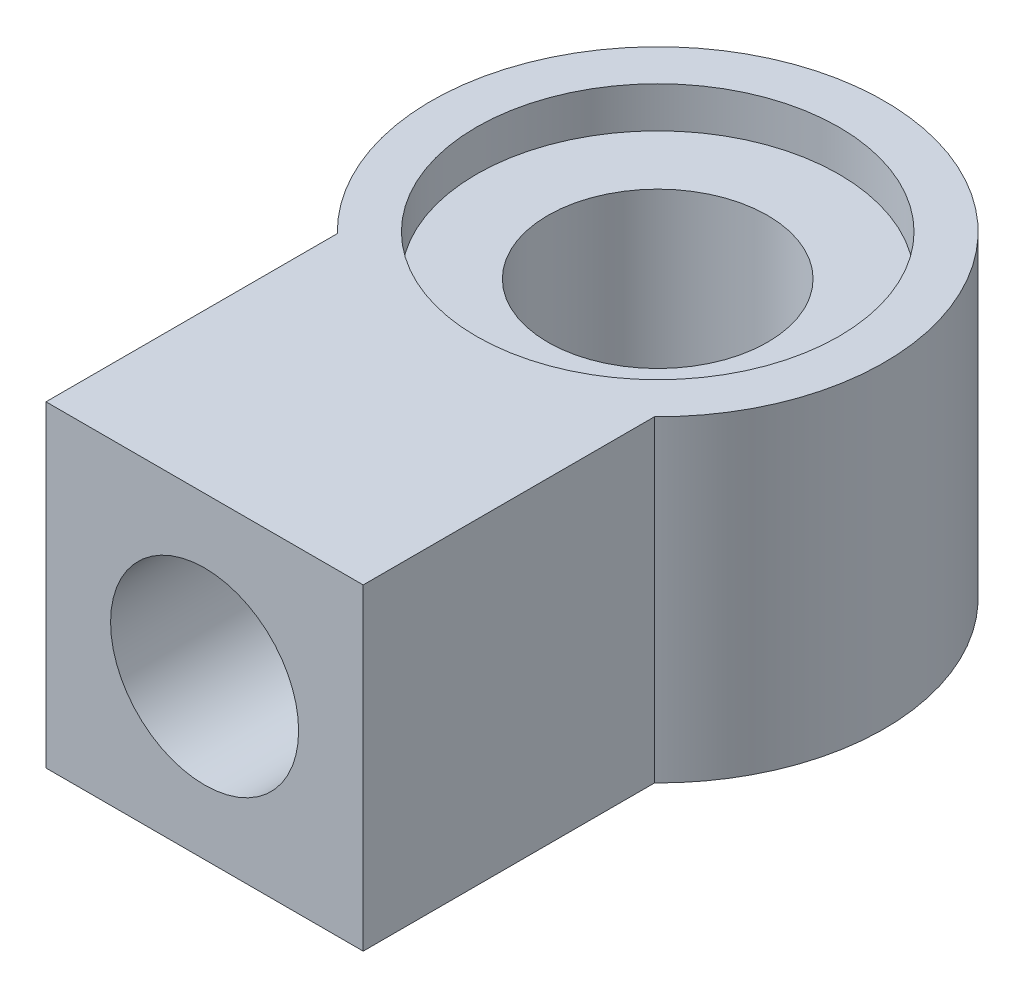
ISO-10303-21;
HEADER;
FILE_DESCRIPTION(('STEP AP214'),'2;1');
FILE_NAME('part.step','',(''),(''),'','','');
FILE_SCHEMA(('AUTOMOTIVE_DESIGN { 1 0 10303 214 1 1 1 1 }'));
ENDSEC;
DATA;
#1=APPLICATION_CONTEXT('core data for automotive mechanical design processes');
#2=APPLICATION_PROTOCOL_DEFINITION('international standard','automotive_design',2000,#1);
#3=PRODUCT_CONTEXT('',#1,'mechanical');
#4=PRODUCT('Part','Part','',(#3));
#5=PRODUCT_RELATED_PRODUCT_CATEGORY('part','',(#4));
#6=PRODUCT_DEFINITION_FORMATION('','',#4);
#7=PRODUCT_DEFINITION_CONTEXT('part definition',#1,'design');
#8=PRODUCT_DEFINITION('design','',#6,#7);
#9=PRODUCT_DEFINITION_SHAPE('','',#8);
#10=(LENGTH_UNIT() NAMED_UNIT(*) SI_UNIT(.MILLI.,.METRE.));
#11=(NAMED_UNIT(*) PLANE_ANGLE_UNIT() SI_UNIT($,.RADIAN.));
#12=(NAMED_UNIT(*) SI_UNIT($,.STERADIAN.) SOLID_ANGLE_UNIT());
#13=UNCERTAINTY_MEASURE_WITH_UNIT(LENGTH_MEASURE(1.E-05),#10,'distance_accuracy_value','');
#14=(GEOMETRIC_REPRESENTATION_CONTEXT(3) GLOBAL_UNCERTAINTY_ASSIGNED_CONTEXT((#13)) GLOBAL_UNIT_ASSIGNED_CONTEXT((#10,
#11,#12)) REPRESENTATION_CONTEXT('',''));
#15=CARTESIAN_POINT('',(0.,0.,0.));
#16=DIRECTION('',(0.,0.,1.));
#17=DIRECTION('',(1.,0.,0.));
#18=AXIS2_PLACEMENT_3D('',#15,#16,#17);
#19=CARTESIAN_POINT('',(0.,7.,0.));
#20=DIRECTION('',(0.,-1.,0.));
#21=DIRECTION('',(0.,0.,-1.));
#22=AXIS2_PLACEMENT_3D('',#19,#20,#21);
#23=CYLINDRICAL_SURFACE('',#22,2.425);
#24=CARTESIAN_POINT('',(0.,0.,0.));
#25=DIRECTION('',(0.,1.,0.));
#26=DIRECTION('',(0.,0.,1.));
#27=AXIS2_PLACEMENT_3D('',#24,#25,#26);
#28=CIRCLE('',#27,2.425);
#29=CARTESIAN_POINT('',(0.,0.,2.425));
#30=VERTEX_POINT('',#29);
#31=EDGE_CURVE('E110',#30,#30,#28,.T.);
#32=ORIENTED_EDGE('',*,*,#31,.F.);
#33=EDGE_LOOP('',(#32));
#34=FACE_BOUND('',#33,.T.);
#35=CARTESIAN_POINT('',(0.,6.1,0.));
#36=DIRECTION('',(0.,1.,0.));
#37=DIRECTION('',(0.,0.,1.));
#38=AXIS2_PLACEMENT_3D('',#35,#36,#37);
#39=CIRCLE('',#38,2.425);
#40=CARTESIAN_POINT('',(0.,6.1,2.425));
#41=VERTEX_POINT('',#40);
#42=EDGE_CURVE('E40',#41,#41,#39,.T.);
#43=ORIENTED_EDGE('',*,*,#42,.T.);
#44=EDGE_LOOP('',(#43));
#45=FACE_BOUND('',#44,.T.);
#46=ADVANCED_FACE('F36',(#34,#45),#23,.F.);
#47=CARTESIAN_POINT('',(0.,7.,0.));
#48=DIRECTION('',(0.,-1.,0.));
#49=DIRECTION('',(0.,0.,-1.));
#50=AXIS2_PLACEMENT_3D('',#47,#48,#49);
#51=CYLINDRICAL_SURFACE('',#50,5.);
#52=DIRECTION('',(0.,-1.,0.));
#53=VECTOR('',#52,1.);
#54=CARTESIAN_POINT('',(3.5,7.,3.57071421427143));
#55=LINE('',#54,#53);
#56=CARTESIAN_POINT('',(3.5,0.,3.57071421427143));
#57=VERTEX_POINT('',#56);
#58=CARTESIAN_POINT('',(3.5,7.,3.57071421427143));
#59=VERTEX_POINT('',#58);
#60=EDGE_CURVE('E45',#57,#59,#55,.F.);
#61=ORIENTED_EDGE('',*,*,#60,.F.);
#62=CARTESIAN_POINT('',(0.,0.,0.));
#63=DIRECTION('',(0.,1.,0.));
#64=DIRECTION('',(0.,0.,1.));
#65=AXIS2_PLACEMENT_3D('',#62,#63,#64);
#66=CIRCLE('',#65,5.);
#67=CARTESIAN_POINT('',(-3.5,0.,3.57071421427142));
#68=VERTEX_POINT('',#67);
#69=EDGE_CURVE('E115',#57,#68,#66,.T.);
#70=ORIENTED_EDGE('',*,*,#69,.T.);
#71=DIRECTION('',(0.,-1.,0.));
#72=VECTOR('',#71,1.);
#73=CARTESIAN_POINT('',(-3.5,7.,3.57071421427142));
#74=LINE('',#73,#72);
#75=CARTESIAN_POINT('',(-3.5,7.,3.57071421427142));
#76=VERTEX_POINT('',#75);
#77=EDGE_CURVE('E80',#68,#76,#74,.F.);
#78=ORIENTED_EDGE('',*,*,#77,.T.);
#79=CARTESIAN_POINT('',(0.,7.,0.));
#80=DIRECTION('',(0.,1.,0.));
#81=DIRECTION('',(0.,0.,1.));
#82=AXIS2_PLACEMENT_3D('',#79,#80,#81);
#83=CIRCLE('',#82,5.);
#84=EDGE_CURVE('E116',#59,#76,#83,.T.);
#85=ORIENTED_EDGE('',*,*,#84,.F.);
#86=EDGE_LOOP('',(#61,#70,#78,#85));
#87=FACE_BOUND('',#86,.T.);
#88=ADVANCED_FACE('F38',(#87),#51,.T.);
#89=CARTESIAN_POINT('',(0.,7.,0.));
#90=DIRECTION('',(0.,1.,0.));
#91=DIRECTION('',(0.,0.,1.));
#92=AXIS2_PLACEMENT_3D('',#89,#90,#91);
#93=PLANE('',#92);
#94=CARTESIAN_POINT('',(0.,7.,0.));
#95=DIRECTION('',(0.,1.,0.));
#96=DIRECTION('',(0.,0.,1.));
#97=AXIS2_PLACEMENT_3D('',#94,#95,#96);
#98=CIRCLE('',#97,4.);
#99=CARTESIAN_POINT('',(0.,7.,4.));
#100=VERTEX_POINT('',#99);
#101=EDGE_CURVE('E149',#100,#100,#98,.T.);
#102=ORIENTED_EDGE('',*,*,#101,.F.);
#103=EDGE_LOOP('',(#102));
#104=FACE_BOUND('',#103,.T.);
#105=DIRECTION('',(0.,0.,1.));
#106=VECTOR('',#105,1.);
#107=CARTESIAN_POINT('',(3.5,7.,3.5));
#108=LINE('',#107,#106);
#109=CARTESIAN_POINT('',(3.5,7.,10.));
#110=VERTEX_POINT('',#109);
#111=EDGE_CURVE('E108',#59,#110,#108,.T.);
#112=ORIENTED_EDGE('',*,*,#111,.F.);
#113=ORIENTED_EDGE('',*,*,#84,.T.);
#114=DIRECTION('',(0.,0.,1.));
#115=VECTOR('',#114,1.);
#116=CARTESIAN_POINT('',(-3.5,7.,3.5));
#117=LINE('',#116,#115);
#118=CARTESIAN_POINT('',(-3.5,7.,10.));
#119=VERTEX_POINT('',#118);
#120=EDGE_CURVE('E52',#76,#119,#117,.T.);
#121=ORIENTED_EDGE('',*,*,#120,.T.);
#122=DIRECTION('',(-1.,0.,0.));
#123=VECTOR('',#122,1.);
#124=CARTESIAN_POINT('',(-3.5,7.,10.));
#125=LINE('',#124,#123);
#126=EDGE_CURVE('E99',#110,#119,#125,.T.);
#127=ORIENTED_EDGE('',*,*,#126,.F.);
#128=EDGE_LOOP('',(#112,#113,#121,#127));
#129=FACE_BOUND('',#128,.T.);
#130=ADVANCED_FACE('F124',(#104,#129),#93,.T.);
#131=CARTESIAN_POINT('',(0.,0.,0.));
#132=DIRECTION('',(0.,1.,0.));
#133=DIRECTION('',(0.,0.,1.));
#134=AXIS2_PLACEMENT_3D('',#131,#132,#133);
#135=PLANE('',#134);
#136=ORIENTED_EDGE('',*,*,#69,.F.);
#137=DIRECTION('',(0.,0.,1.));
#138=VECTOR('',#137,1.);
#139=CARTESIAN_POINT('',(3.5,0.,3.5));
#140=LINE('',#139,#138);
#141=CARTESIAN_POINT('',(3.5,0.,10.));
#142=VERTEX_POINT('',#141);
#143=EDGE_CURVE('E84',#57,#142,#140,.T.);
#144=ORIENTED_EDGE('',*,*,#143,.T.);
#145=DIRECTION('',(1.,0.,0.));
#146=VECTOR('',#145,1.);
#147=CARTESIAN_POINT('',(-3.5,0.,10.));
#148=LINE('',#147,#146);
#149=CARTESIAN_POINT('',(-3.5,0.,10.));
#150=VERTEX_POINT('',#149);
#151=EDGE_CURVE('E87',#150,#142,#148,.T.);
#152=ORIENTED_EDGE('',*,*,#151,.F.);
#153=DIRECTION('',(0.,0.,1.));
#154=VECTOR('',#153,1.);
#155=CARTESIAN_POINT('',(-3.5,0.,3.5));
#156=LINE('',#155,#154);
#157=EDGE_CURVE('E75',#68,#150,#156,.T.);
#158=ORIENTED_EDGE('',*,*,#157,.F.);
#159=EDGE_LOOP('',(#136,#144,#152,#158));
#160=FACE_BOUND('',#159,.T.);
#161=ORIENTED_EDGE('',*,*,#31,.T.);
#162=EDGE_LOOP('',(#161));
#163=FACE_BOUND('',#162,.T.);
#164=ADVANCED_FACE('F88',(#160,#163),#135,.F.);
#165=CARTESIAN_POINT('',(3.5,0.,3.5));
#166=DIRECTION('',(-1.,0.,0.));
#167=DIRECTION('',(0.,-1.,0.));
#168=AXIS2_PLACEMENT_3D('',#165,#166,#167);
#169=PLANE('',#168);
#170=ORIENTED_EDGE('',*,*,#143,.F.);
#171=ORIENTED_EDGE('',*,*,#60,.T.);
#172=ORIENTED_EDGE('',*,*,#111,.T.);
#173=DIRECTION('',(0.,1.,0.));
#174=VECTOR('',#173,1.);
#175=CARTESIAN_POINT('',(3.5,7.,10.));
#176=LINE('',#175,#174);
#177=EDGE_CURVE('E93',#142,#110,#176,.T.);
#178=ORIENTED_EDGE('',*,*,#177,.F.);
#179=EDGE_LOOP('',(#170,#171,#172,#178));
#180=FACE_BOUND('',#179,.T.);
#181=ADVANCED_FACE('F125',(#180),#169,.F.);
#182=CARTESIAN_POINT('',(-3.5,0.,3.5));
#183=DIRECTION('',(-1.,0.,0.));
#184=DIRECTION('',(0.,-1.,0.));
#185=AXIS2_PLACEMENT_3D('',#182,#183,#184);
#186=PLANE('',#185);
#187=ORIENTED_EDGE('',*,*,#77,.F.);
#188=ORIENTED_EDGE('',*,*,#157,.T.);
#189=DIRECTION('',(0.,-1.,0.));
#190=VECTOR('',#189,1.);
#191=CARTESIAN_POINT('',(-3.5,7.,10.));
#192=LINE('',#191,#190);
#193=EDGE_CURVE('E79',#119,#150,#192,.T.);
#194=ORIENTED_EDGE('',*,*,#193,.F.);
#195=ORIENTED_EDGE('',*,*,#120,.F.);
#196=EDGE_LOOP('',(#187,#188,#194,#195));
#197=FACE_BOUND('',#196,.T.);
#198=ADVANCED_FACE('F77',(#197),#186,.T.);
#199=CARTESIAN_POINT('',(0.,0.,10.));
#200=DIRECTION('',(0.,0.,1.));
#201=DIRECTION('',(1.,0.,0.));
#202=AXIS2_PLACEMENT_3D('',#199,#200,#201);
#203=PLANE('',#202);
#204=ORIENTED_EDGE('',*,*,#193,.T.);
#205=ORIENTED_EDGE('',*,*,#151,.T.);
#206=ORIENTED_EDGE('',*,*,#177,.T.);
#207=ORIENTED_EDGE('',*,*,#126,.T.);
#208=EDGE_LOOP('',(#204,#205,#206,#207));
#209=FACE_BOUND('',#208,.T.);
#210=CARTESIAN_POINT('',(0.,3.5,10.));
#211=DIRECTION('',(0.,0.,1.));
#212=DIRECTION('',(1.,0.,0.));
#213=AXIS2_PLACEMENT_3D('',#210,#211,#212);
#214=CIRCLE('',#213,2.075);
#215=CARTESIAN_POINT('',(2.075,3.5,10.));
#216=VERTEX_POINT('',#215);
#217=EDGE_CURVE('E100',#216,#216,#214,.T.);
#218=ORIENTED_EDGE('',*,*,#217,.F.);
#219=EDGE_LOOP('',(#218));
#220=FACE_BOUND('',#219,.T.);
#221=ADVANCED_FACE('F96',(#209,#220),#203,.T.);
#222=CARTESIAN_POINT('',(0.,3.5,10.));
#223=DIRECTION('',(0.,0.,-1.));
#224=DIRECTION('',(-1.,0.,0.));
#225=AXIS2_PLACEMENT_3D('',#222,#223,#224);
#226=CYLINDRICAL_SURFACE('',#225,2.075);
#227=ORIENTED_EDGE('',*,*,#217,.T.);
#228=EDGE_LOOP('',(#227));
#229=FACE_BOUND('',#228,.T.);
#230=CARTESIAN_POINT('',(0.,3.5,5.));
#231=DIRECTION('',(0.,0.,1.));
#232=DIRECTION('',(1.,0.,0.));
#233=AXIS2_PLACEMENT_3D('',#230,#231,#232);
#234=CIRCLE('',#233,2.075);
#235=CARTESIAN_POINT('',(2.075,3.5,5.));
#236=VERTEX_POINT('',#235);
#237=EDGE_CURVE('E11',#236,#236,#234,.F.);
#238=ORIENTED_EDGE('',*,*,#237,.T.);
#239=EDGE_LOOP('',(#238));
#240=FACE_BOUND('',#239,.T.);
#241=ADVANCED_FACE('F170',(#229,#240),#226,.F.);
#242=CARTESIAN_POINT('',(0.,0.,5.));
#243=DIRECTION('',(0.,0.,1.));
#244=DIRECTION('',(1.,0.,0.));
#245=AXIS2_PLACEMENT_3D('',#242,#243,#244);
#246=PLANE('',#245);
#247=ORIENTED_EDGE('',*,*,#237,.F.);
#248=EDGE_LOOP('',(#247));
#249=FACE_BOUND('',#248,.T.);
#250=ADVANCED_FACE('F166',(#249),#246,.T.);
#251=CARTESIAN_POINT('',(0.,6.1,0.));
#252=DIRECTION('',(0.,1.,0.));
#253=DIRECTION('',(0.,0.,1.));
#254=AXIS2_PLACEMENT_3D('',#251,#252,#253);
#255=CYLINDRICAL_SURFACE('',#254,4.);
#256=CARTESIAN_POINT('',(0.,6.1,0.));
#257=DIRECTION('',(0.,1.,0.));
#258=DIRECTION('',(0.,0.,1.));
#259=AXIS2_PLACEMENT_3D('',#256,#257,#258);
#260=CIRCLE('',#259,4.);
#261=CARTESIAN_POINT('',(0.,6.1,4.));
#262=VERTEX_POINT('',#261);
#263=EDGE_CURVE('E151',#262,#262,#260,.T.);
#264=ORIENTED_EDGE('',*,*,#263,.F.);
#265=EDGE_LOOP('',(#264));
#266=FACE_BOUND('',#265,.T.);
#267=ORIENTED_EDGE('',*,*,#101,.T.);
#268=EDGE_LOOP('',(#267));
#269=FACE_BOUND('',#268,.T.);
#270=ADVANCED_FACE('F161',(#266,#269),#255,.F.);
#271=CARTESIAN_POINT('',(0.,6.1,0.));
#272=DIRECTION('',(0.,1.,0.));
#273=DIRECTION('',(0.,0.,1.));
#274=AXIS2_PLACEMENT_3D('',#271,#272,#273);
#275=PLANE('',#274);
#276=ORIENTED_EDGE('',*,*,#42,.F.);
#277=EDGE_LOOP('',(#276));
#278=FACE_BOUND('',#277,.T.);
#279=ORIENTED_EDGE('',*,*,#263,.T.);
#280=EDGE_LOOP('',(#279));
#281=FACE_BOUND('',#280,.T.);
#282=ADVANCED_FACE('F159',(#278,#281),#275,.T.);
#283=CLOSED_SHELL('',(#46,#88,#130,#164,#181,#198,#221,#241,#250,#270,#282));
#284=MANIFOLD_SOLID_BREP('B2',#283);
#285=ADVANCED_BREP_SHAPE_REPRESENTATION('',(#18,#284),#14);
#286=SHAPE_DEFINITION_REPRESENTATION(#9,#285);
ENDSEC;
END-ISO-10303-21;
